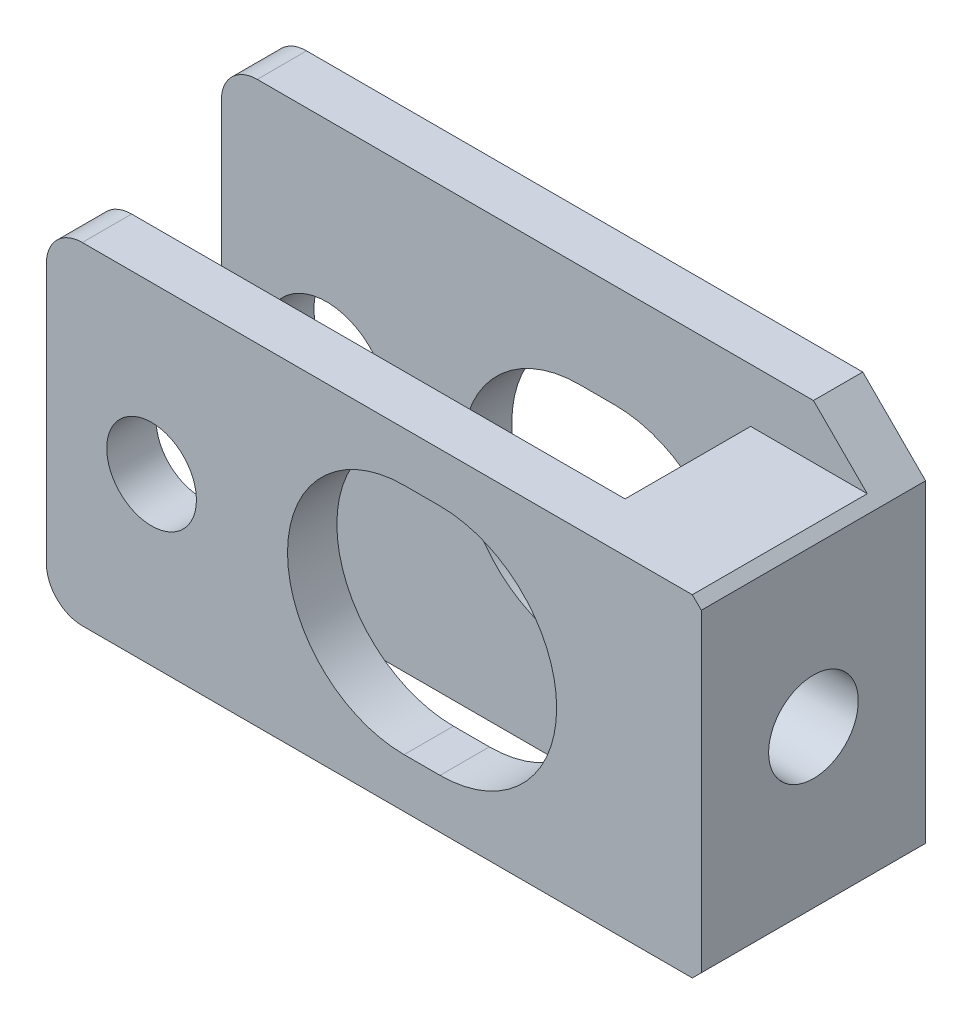
ISO-10303-21;
HEADER;
FILE_DESCRIPTION(('STEP AP214'),'2;1');
FILE_NAME('part.step','',(''),(''),'','','');
FILE_SCHEMA(('AUTOMOTIVE_DESIGN { 1 0 10303 214 1 1 1 1 }'));
ENDSEC;
DATA;
#1=APPLICATION_CONTEXT('core data for automotive mechanical design processes');
#2=APPLICATION_PROTOCOL_DEFINITION('international standard','automotive_design',2000,#1);
#3=PRODUCT_CONTEXT('',#1,'mechanical');
#4=PRODUCT('Part','Part','',(#3));
#5=PRODUCT_RELATED_PRODUCT_CATEGORY('part','',(#4));
#6=PRODUCT_DEFINITION_FORMATION('','',#4);
#7=PRODUCT_DEFINITION_CONTEXT('part definition',#1,'design');
#8=PRODUCT_DEFINITION('design','',#6,#7);
#9=PRODUCT_DEFINITION_SHAPE('','',#8);
#10=(LENGTH_UNIT() NAMED_UNIT(*) SI_UNIT(.MILLI.,.METRE.));
#11=(NAMED_UNIT(*) PLANE_ANGLE_UNIT() SI_UNIT($,.RADIAN.));
#12=(NAMED_UNIT(*) SI_UNIT($,.STERADIAN.) SOLID_ANGLE_UNIT());
#13=UNCERTAINTY_MEASURE_WITH_UNIT(LENGTH_MEASURE(1.E-05),#10,'distance_accuracy_value','');
#14=(GEOMETRIC_REPRESENTATION_CONTEXT(3) GLOBAL_UNCERTAINTY_ASSIGNED_CONTEXT((#13)) GLOBAL_UNIT_ASSIGNED_CONTEXT((#10,
#11,#12)) REPRESENTATION_CONTEXT('',''));
#15=CARTESIAN_POINT('',(0.,0.,0.));
#16=DIRECTION('',(0.,0.,1.));
#17=DIRECTION('',(1.,0.,0.));
#18=AXIS2_PLACEMENT_3D('',#15,#16,#17);
#19=CARTESIAN_POINT('',(234.055597075058,218.565954180002,12.5));
#20=DIRECTION('',(0.,1.,0.));
#21=DIRECTION('',(-1.,0.,0.));
#22=AXIS2_PLACEMENT_3D('',#19,#20,#21);
#23=PLANE('',#22);
#24=DIRECTION('',(1.,0.,0.));
#25=VECTOR('',#24,1.);
#26=CARTESIAN_POINT('',(234.055597075058,218.565954180002,12.5));
#27=LINE('',#26,#25);
#28=CARTESIAN_POINT('',(236.055597075058,218.565954180002,12.5));
#29=VERTEX_POINT('',#28);
#30=CARTESIAN_POINT('',(270.055597075058,218.565954180002,12.5));
#31=VERTEX_POINT('',#30);
#32=EDGE_CURVE('E369',#29,#31,#27,.T.);
#33=ORIENTED_EDGE('',*,*,#32,.F.);
#34=DIRECTION('',(0.,0.,-1.));
#35=VECTOR('',#34,1.);
#36=CARTESIAN_POINT('',(236.055597075058,218.565954180002,12.5));
#37=LINE('',#36,#35);
#38=CARTESIAN_POINT('',(236.055597075058,218.565954180002,9.75));
#39=VERTEX_POINT('',#38);
#40=EDGE_CURVE('E40',#29,#39,#37,.T.);
#41=ORIENTED_EDGE('',*,*,#40,.T.);
#42=DIRECTION('',(1.,0.,0.));
#43=VECTOR('',#42,1.);
#44=CARTESIAN_POINT('',(234.055597075058,218.565954180002,9.75));
#45=LINE('',#44,#43);
#46=CARTESIAN_POINT('',(263.555597075058,218.565954180002,9.75));
#47=VERTEX_POINT('',#46);
#48=EDGE_CURVE('E367',#39,#47,#45,.T.);
#49=ORIENTED_EDGE('',*,*,#48,.T.);
#50=DIRECTION('',(0.,0.,-1.));
#51=VECTOR('',#50,1.);
#52=CARTESIAN_POINT('',(263.555597075058,218.565954180002,2.75));
#53=LINE('',#52,#51);
#54=CARTESIAN_POINT('',(263.555597075058,218.565954180002,2.75));
#55=VERTEX_POINT('',#54);
#56=EDGE_CURVE('E379',#47,#55,#53,.T.);
#57=ORIENTED_EDGE('',*,*,#56,.T.);
#58=DIRECTION('',(-1.,0.,0.));
#59=VECTOR('',#58,1.);
#60=CARTESIAN_POINT('',(234.055597075058,218.565954180002,2.75));
#61=LINE('',#60,#59);
#62=CARTESIAN_POINT('',(270.055597075058,218.565954180002,2.75));
#63=VERTEX_POINT('',#62);
#64=EDGE_CURVE('E287',#63,#55,#61,.T.);
#65=ORIENTED_EDGE('',*,*,#64,.F.);
#66=DIRECTION('',(0.,0.,-1.));
#67=VECTOR('',#66,1.);
#68=CARTESIAN_POINT('',(270.055597075058,218.565954180002,2.75));
#69=LINE('',#68,#67);
#70=EDGE_CURVE('E311',#63,#31,#69,.F.);
#71=ORIENTED_EDGE('',*,*,#70,.T.);
#72=EDGE_LOOP('',(#33,#41,#49,#57,#65,#71));
#73=FACE_BOUND('',#72,.T.);
#74=ADVANCED_FACE('F32',(#73),#23,.F.);
#75=CARTESIAN_POINT('',(234.055597075058,237.065954180002,12.5));
#76=DIRECTION('',(0.,-1.,0.));
#77=DIRECTION('',(0.,0.,-1.));
#78=AXIS2_PLACEMENT_3D('',#75,#76,#77);
#79=PLANE('',#78);
#80=DIRECTION('',(1.,0.,0.));
#81=VECTOR('',#80,1.);
#82=CARTESIAN_POINT('',(234.055597075058,237.065954180002,9.75));
#83=LINE('',#82,#81);
#84=CARTESIAN_POINT('',(236.055597075058,237.065954180002,9.75));
#85=VERTEX_POINT('',#84);
#86=CARTESIAN_POINT('',(263.555597075058,237.065954180002,9.75));
#87=VERTEX_POINT('',#86);
#88=EDGE_CURVE('E385',#85,#87,#83,.T.);
#89=ORIENTED_EDGE('',*,*,#88,.F.);
#90=DIRECTION('',(0.,0.,-1.));
#91=VECTOR('',#90,1.);
#92=CARTESIAN_POINT('',(236.055597075058,237.065954180002,12.5));
#93=LINE('',#92,#91);
#94=CARTESIAN_POINT('',(236.055597075058,237.065954180002,12.5));
#95=VERTEX_POINT('',#94);
#96=EDGE_CURVE('E55',#85,#95,#93,.F.);
#97=ORIENTED_EDGE('',*,*,#96,.T.);
#98=DIRECTION('',(-1.,0.,0.));
#99=VECTOR('',#98,1.);
#100=CARTESIAN_POINT('',(234.055597075058,237.065954180002,12.5));
#101=LINE('',#100,#99);
#102=CARTESIAN_POINT('',(270.055597075058,237.065954180002,12.5));
#103=VERTEX_POINT('',#102);
#104=EDGE_CURVE('E462',#103,#95,#101,.T.);
#105=ORIENTED_EDGE('',*,*,#104,.F.);
#106=DIRECTION('',(0.,0.,-1.));
#107=VECTOR('',#106,1.);
#108=CARTESIAN_POINT('',(270.055597075058,237.065954180002,2.75));
#109=LINE('',#108,#107);
#110=CARTESIAN_POINT('',(270.055597075058,237.065954180002,2.75));
#111=VERTEX_POINT('',#110);
#112=EDGE_CURVE('E330',#103,#111,#109,.T.);
#113=ORIENTED_EDGE('',*,*,#112,.T.);
#114=DIRECTION('',(1.,0.,0.));
#115=VECTOR('',#114,1.);
#116=CARTESIAN_POINT('',(234.055597075058,237.065954180002,2.75));
#117=LINE('',#116,#115);
#118=CARTESIAN_POINT('',(263.555597075058,237.065954180002,2.75));
#119=VERTEX_POINT('',#118);
#120=EDGE_CURVE('E466',#119,#111,#117,.T.);
#121=ORIENTED_EDGE('',*,*,#120,.F.);
#122=DIRECTION('',(0.,0.,-1.));
#123=VECTOR('',#122,1.);
#124=CARTESIAN_POINT('',(263.555597075058,237.065954180002,2.75));
#125=LINE('',#124,#123);
#126=EDGE_CURVE('E380',#87,#119,#125,.T.);
#127=ORIENTED_EDGE('',*,*,#126,.F.);
#128=EDGE_LOOP('',(#89,#97,#105,#113,#121,#127));
#129=FACE_BOUND('',#128,.T.);
#130=ADVANCED_FACE('F546',(#129),#79,.F.);
#131=CARTESIAN_POINT('',(234.055597075058,237.065954180002,12.5));
#132=DIRECTION('',(1.,0.,0.));
#133=DIRECTION('',(0.,1.,0.));
#134=AXIS2_PLACEMENT_3D('',#131,#132,#133);
#135=PLANE('',#134);
#136=DIRECTION('',(0.,1.,0.));
#137=VECTOR('',#136,1.);
#138=CARTESIAN_POINT('',(234.055597075058,218.565954180002,2.75));
#139=LINE('',#138,#137);
#140=CARTESIAN_POINT('',(234.055597075058,217.565954180002,2.75));
#141=VERTEX_POINT('',#140);
#142=CARTESIAN_POINT('',(234.055597075058,238.065954180002,2.75));
#143=VERTEX_POINT('',#142);
#144=EDGE_CURVE('E393',#141,#143,#139,.T.);
#145=ORIENTED_EDGE('',*,*,#144,.T.);
#146=DIRECTION('',(0.,0.,1.));
#147=VECTOR('',#146,1.);
#148=CARTESIAN_POINT('',(234.055597075058,238.065954180002,0.));
#149=LINE('',#148,#147);
#150=CARTESIAN_POINT('',(234.055597075058,238.065954180002,0.));
#151=VERTEX_POINT('',#150);
#152=EDGE_CURVE('E344',#143,#151,#149,.F.);
#153=ORIENTED_EDGE('',*,*,#152,.T.);
#154=DIRECTION('',(0.,-1.,0.));
#155=VECTOR('',#154,1.);
#156=CARTESIAN_POINT('',(234.055597075058,237.065954180002,0.));
#157=LINE('',#156,#155);
#158=CARTESIAN_POINT('',(234.055597075058,217.565954180002,0.));
#159=VERTEX_POINT('',#158);
#160=EDGE_CURVE('E459',#151,#159,#157,.T.);
#161=ORIENTED_EDGE('',*,*,#160,.T.);
#162=DIRECTION('',(0.,0.,-1.));
#163=VECTOR('',#162,1.);
#164=CARTESIAN_POINT('',(234.055597075058,217.565954180002,12.5));
#165=LINE('',#164,#163);
#166=EDGE_CURVE('E342',#159,#141,#165,.F.);
#167=ORIENTED_EDGE('',*,*,#166,.T.);
#168=EDGE_LOOP('',(#145,#153,#161,#167));
#169=FACE_BOUND('',#168,.T.);
#170=ADVANCED_FACE('F526',(#169),#135,.F.);
#171=CARTESIAN_POINT('',(253.993323780456,227.815954180002,12.5));
#172=DIRECTION('',(0.,0.,-1.));
#173=DIRECTION('',(-1.,0.,0.));
#174=AXIS2_PLACEMENT_3D('',#171,#172,#173);
#175=CYLINDRICAL_SURFACE('',#174,6.50000000000001);
#176=CARTESIAN_POINT('',(253.993323780456,227.815954180002,2.75));
#177=DIRECTION('',(0.,0.,-1.));
#178=DIRECTION('',(-1.,0.,0.));
#179=AXIS2_PLACEMENT_3D('',#176,#177,#178);
#180=CIRCLE('',#179,6.50000000000001);
#181=CARTESIAN_POINT('',(253.993323780456,221.315954180002,2.75));
#182=VERTEX_POINT('',#181);
#183=CARTESIAN_POINT('',(253.993323780456,234.315954180002,2.75));
#184=VERTEX_POINT('',#183);
#185=EDGE_CURVE('E414',#182,#184,#180,.T.);
#186=ORIENTED_EDGE('',*,*,#185,.F.);
#187=DIRECTION('',(0.,0.,-1.));
#188=VECTOR('',#187,1.);
#189=CARTESIAN_POINT('',(253.993323780456,221.315954180002,12.5));
#190=LINE('',#189,#188);
#191=CARTESIAN_POINT('',(253.993323780456,221.315954180002,0.));
#192=VERTEX_POINT('',#191);
#193=EDGE_CURVE('E452',#182,#192,#190,.T.);
#194=ORIENTED_EDGE('',*,*,#193,.T.);
#195=CARTESIAN_POINT('',(253.993323780456,227.815954180002,0.));
#196=DIRECTION('',(0.,0.,1.));
#197=DIRECTION('',(1.,0.,0.));
#198=AXIS2_PLACEMENT_3D('',#195,#196,#197);
#199=CIRCLE('',#198,6.50000000000001);
#200=CARTESIAN_POINT('',(253.993323780456,234.315954180002,0.));
#201=VERTEX_POINT('',#200);
#202=EDGE_CURVE('E419',#201,#192,#199,.T.);
#203=ORIENTED_EDGE('',*,*,#202,.F.);
#204=DIRECTION('',(0.,0.,-1.));
#205=VECTOR('',#204,1.);
#206=CARTESIAN_POINT('',(253.993323780456,234.315954180002,12.5));
#207=LINE('',#206,#205);
#208=EDGE_CURVE('E430',#184,#201,#207,.T.);
#209=ORIENTED_EDGE('',*,*,#208,.F.);
#210=EDGE_LOOP('',(#186,#194,#203,#209));
#211=FACE_BOUND('',#210,.T.);
#212=ADVANCED_FACE('F613',(#211),#175,.F.);
#213=CARTESIAN_POINT('',(253.993323780456,221.315954180002,12.5));
#214=DIRECTION('',(0.,1.,0.));
#215=DIRECTION('',(0.,0.,1.));
#216=AXIS2_PLACEMENT_3D('',#213,#214,#215);
#217=PLANE('',#216);
#218=DIRECTION('',(-1.,0.,0.));
#219=VECTOR('',#218,1.);
#220=CARTESIAN_POINT('',(253.993323780456,221.315954180002,2.75));
#221=LINE('',#220,#219);
#222=CARTESIAN_POINT('',(255.993323780456,221.315954180002,2.75));
#223=VERTEX_POINT('',#222);
#224=EDGE_CURVE('E412',#223,#182,#221,.T.);
#225=ORIENTED_EDGE('',*,*,#224,.F.);
#226=DIRECTION('',(0.,0.,-1.));
#227=VECTOR('',#226,1.);
#228=CARTESIAN_POINT('',(255.993323780456,221.315954180002,12.5));
#229=LINE('',#228,#227);
#230=CARTESIAN_POINT('',(255.993323780456,221.315954180002,0.));
#231=VERTEX_POINT('',#230);
#232=EDGE_CURVE('E448',#223,#231,#229,.T.);
#233=ORIENTED_EDGE('',*,*,#232,.T.);
#234=DIRECTION('',(1.,0.,0.));
#235=VECTOR('',#234,1.);
#236=CARTESIAN_POINT('',(253.993323780456,221.315954180002,0.));
#237=LINE('',#236,#235);
#238=EDGE_CURVE('E433',#192,#231,#237,.T.);
#239=ORIENTED_EDGE('',*,*,#238,.F.);
#240=ORIENTED_EDGE('',*,*,#193,.F.);
#241=EDGE_LOOP('',(#225,#233,#239,#240));
#242=FACE_BOUND('',#241,.T.);
#243=ADVANCED_FACE('F608',(#242),#217,.T.);
#244=CARTESIAN_POINT('',(255.993323780456,227.815954180002,12.5));
#245=DIRECTION('',(0.,0.,-1.));
#246=DIRECTION('',(-1.,0.,0.));
#247=AXIS2_PLACEMENT_3D('',#244,#245,#246);
#248=CYLINDRICAL_SURFACE('',#247,6.50000000000001);
#249=CARTESIAN_POINT('',(255.993323780456,227.815954180002,2.75));
#250=DIRECTION('',(0.,0.,-1.));
#251=DIRECTION('',(-1.,0.,0.));
#252=AXIS2_PLACEMENT_3D('',#249,#250,#251);
#253=CIRCLE('',#252,6.50000000000001);
#254=CARTESIAN_POINT('',(255.993323780456,234.315954180002,2.75));
#255=VERTEX_POINT('',#254);
#256=EDGE_CURVE('E410',#255,#223,#253,.T.);
#257=ORIENTED_EDGE('',*,*,#256,.F.);
#258=DIRECTION('',(0.,0.,-1.));
#259=VECTOR('',#258,1.);
#260=CARTESIAN_POINT('',(255.993323780456,234.315954180002,12.5));
#261=LINE('',#260,#259);
#262=CARTESIAN_POINT('',(255.993323780456,234.315954180002,0.));
#263=VERTEX_POINT('',#262);
#264=EDGE_CURVE('E444',#255,#263,#261,.T.);
#265=ORIENTED_EDGE('',*,*,#264,.T.);
#266=CARTESIAN_POINT('',(255.993323780456,227.815954180002,0.));
#267=DIRECTION('',(0.,0.,1.));
#268=DIRECTION('',(1.,0.,0.));
#269=AXIS2_PLACEMENT_3D('',#266,#267,#268);
#270=CIRCLE('',#269,6.50000000000001);
#271=EDGE_CURVE('E436',#231,#263,#270,.T.);
#272=ORIENTED_EDGE('',*,*,#271,.F.);
#273=ORIENTED_EDGE('',*,*,#232,.F.);
#274=EDGE_LOOP('',(#257,#265,#272,#273));
#275=FACE_BOUND('',#274,.T.);
#276=ADVANCED_FACE('F603',(#275),#248,.F.);
#277=CARTESIAN_POINT('',(253.993323780456,234.315954180002,12.5));
#278=DIRECTION('',(0.,-1.,0.));
#279=DIRECTION('',(0.,0.,-1.));
#280=AXIS2_PLACEMENT_3D('',#277,#278,#279);
#281=PLANE('',#280);
#282=DIRECTION('',(1.,0.,0.));
#283=VECTOR('',#282,1.);
#284=CARTESIAN_POINT('',(253.993323780456,234.315954180002,2.75));
#285=LINE('',#284,#283);
#286=EDGE_CURVE('E408',#184,#255,#285,.T.);
#287=ORIENTED_EDGE('',*,*,#286,.F.);
#288=ORIENTED_EDGE('',*,*,#208,.T.);
#289=DIRECTION('',(-1.,0.,0.));
#290=VECTOR('',#289,1.);
#291=CARTESIAN_POINT('',(253.993323780456,234.315954180002,0.));
#292=LINE('',#291,#290);
#293=EDGE_CURVE('E423',#263,#201,#292,.T.);
#294=ORIENTED_EDGE('',*,*,#293,.F.);
#295=ORIENTED_EDGE('',*,*,#264,.F.);
#296=EDGE_LOOP('',(#287,#288,#294,#295));
#297=FACE_BOUND('',#296,.T.);
#298=ADVANCED_FACE('F593',(#297),#281,.T.);
#299=CARTESIAN_POINT('',(239.915979081558,227.815953297462,12.5));
#300=DIRECTION('',(0.,0.,-1.));
#301=DIRECTION('',(-1.,0.,0.));
#302=AXIS2_PLACEMENT_3D('',#299,#300,#301);
#303=CYLINDRICAL_SURFACE('',#302,3.45);
#304=CARTESIAN_POINT('',(239.915979081558,227.815953297462,2.75));
#305=DIRECTION('',(0.,0.,-1.));
#306=DIRECTION('',(-1.,0.,0.));
#307=AXIS2_PLACEMENT_3D('',#304,#305,#306);
#308=CIRCLE('',#307,3.45);
#309=CARTESIAN_POINT('',(236.465979081558,227.815953297462,2.75));
#310=VERTEX_POINT('',#309);
#311=EDGE_CURVE('E407',#310,#310,#308,.T.);
#312=ORIENTED_EDGE('',*,*,#311,.F.);
#313=EDGE_LOOP('',(#312));
#314=FACE_BOUND('',#313,.T.);
#315=CARTESIAN_POINT('',(239.915979081558,227.815953297462,0.));
#316=DIRECTION('',(0.,0.,1.));
#317=DIRECTION('',(1.,0.,0.));
#318=AXIS2_PLACEMENT_3D('',#315,#316,#317);
#319=CIRCLE('',#318,3.45);
#320=CARTESIAN_POINT('',(243.365979081558,227.815953297462,0.));
#321=VERTEX_POINT('',#320);
#322=EDGE_CURVE('E416',#321,#321,#319,.T.);
#323=ORIENTED_EDGE('',*,*,#322,.F.);
#324=EDGE_LOOP('',(#323));
#325=FACE_BOUND('',#324,.T.);
#326=ADVANCED_FACE('F589',(#314,#325),#303,.F.);
#327=CARTESIAN_POINT('',(270.555597075058,218.565954180002,12.5));
#328=DIRECTION('',(0.,0.,1.));
#329=DIRECTION('',(1.,0.,0.));
#330=AXIS2_PLACEMENT_3D('',#327,#328,#329);
#331=PLANE('',#330);
#332=DIRECTION('',(1.,0.,0.));
#333=VECTOR('',#332,1.);
#334=CARTESIAN_POINT('',(253.993323780456,221.315954180002,12.5));
#335=LINE('',#334,#333);
#336=CARTESIAN_POINT('',(253.993323780456,221.315954180002,12.5));
#337=VERTEX_POINT('',#336);
#338=CARTESIAN_POINT('',(255.993323780456,221.315954180002,12.5));
#339=VERTEX_POINT('',#338);
#340=EDGE_CURVE('E422',#337,#339,#335,.T.);
#341=ORIENTED_EDGE('',*,*,#340,.F.);
#342=CARTESIAN_POINT('',(253.993323780456,227.815954180002,12.5));
#343=DIRECTION('',(0.,0.,1.));
#344=DIRECTION('',(1.,0.,0.));
#345=AXIS2_PLACEMENT_3D('',#342,#343,#344);
#346=CIRCLE('',#345,6.50000000000001);
#347=CARTESIAN_POINT('',(253.993323780456,234.315954180002,12.5));
#348=VERTEX_POINT('',#347);
#349=EDGE_CURVE('E420',#348,#337,#346,.T.);
#350=ORIENTED_EDGE('',*,*,#349,.F.);
#351=DIRECTION('',(-1.,0.,0.));
#352=VECTOR('',#351,1.);
#353=CARTESIAN_POINT('',(253.993323780456,234.315954180002,12.5));
#354=LINE('',#353,#352);
#355=CARTESIAN_POINT('',(255.993323780456,234.315954180002,12.5));
#356=VERTEX_POINT('',#355);
#357=EDGE_CURVE('E428',#356,#348,#354,.T.);
#358=ORIENTED_EDGE('',*,*,#357,.F.);
#359=CARTESIAN_POINT('',(255.993323780456,227.815954180002,12.5));
#360=DIRECTION('',(0.,0.,1.));
#361=DIRECTION('',(1.,0.,0.));
#362=AXIS2_PLACEMENT_3D('',#359,#360,#361);
#363=CIRCLE('',#362,6.50000000000001);
#364=EDGE_CURVE('E425',#339,#356,#363,.T.);
#365=ORIENTED_EDGE('',*,*,#364,.F.);
#366=EDGE_LOOP('',(#341,#350,#358,#365));
#367=FACE_BOUND('',#366,.T.);
#368=ORIENTED_EDGE('',*,*,#104,.T.);
#369=CARTESIAN_POINT('',(236.055597075058,235.065954180002,12.5));
#370=DIRECTION('',(0.,0.,1.));
#371=DIRECTION('',(1.,0.,0.));
#372=AXIS2_PLACEMENT_3D('',#369,#370,#371);
#373=CIRCLE('',#372,2.);
#374=CARTESIAN_POINT('',(234.055597075058,235.065954180002,12.5));
#375=VERTEX_POINT('',#374);
#376=EDGE_CURVE('E361',#95,#375,#373,.T.);
#377=ORIENTED_EDGE('',*,*,#376,.T.);
#378=DIRECTION('',(0.,-1.,0.));
#379=VECTOR('',#378,1.);
#380=CARTESIAN_POINT('',(234.055597075058,237.065954180002,12.5));
#381=LINE('',#380,#379);
#382=CARTESIAN_POINT('',(234.055597075058,220.565954180002,12.5));
#383=VERTEX_POINT('',#382);
#384=EDGE_CURVE('E464',#375,#383,#381,.T.);
#385=ORIENTED_EDGE('',*,*,#384,.T.);
#386=CARTESIAN_POINT('',(236.055597075058,220.565954180002,12.5));
#387=DIRECTION('',(0.,0.,1.));
#388=DIRECTION('',(1.,0.,0.));
#389=AXIS2_PLACEMENT_3D('',#386,#387,#388);
#390=CIRCLE('',#389,2.);
#391=EDGE_CURVE('E47',#383,#29,#390,.T.);
#392=ORIENTED_EDGE('',*,*,#391,.T.);
#393=ORIENTED_EDGE('',*,*,#32,.T.);
#394=DIRECTION('',(-0.707106781186548,-0.707106781186548,0.));
#395=VECTOR('',#394,1.);
#396=CARTESIAN_POINT('',(270.305597075058,218.815954180002,12.5));
#397=LINE('',#396,#395);
#398=CARTESIAN_POINT('',(270.555597075058,219.065954180002,12.5));
#399=VERTEX_POINT('',#398);
#400=EDGE_CURVE('E314',#31,#399,#397,.F.);
#401=ORIENTED_EDGE('',*,*,#400,.T.);
#402=DIRECTION('',(0.,1.,0.));
#403=VECTOR('',#402,1.);
#404=CARTESIAN_POINT('',(270.555597075058,218.565954180002,12.5));
#405=LINE('',#404,#403);
#406=CARTESIAN_POINT('',(270.555597075058,236.565954180002,12.5));
#407=VERTEX_POINT('',#406);
#408=EDGE_CURVE('E458',#399,#407,#405,.T.);
#409=ORIENTED_EDGE('',*,*,#408,.T.);
#410=DIRECTION('',(-0.707106781186548,0.707106781186548,0.));
#411=VECTOR('',#410,1.);
#412=CARTESIAN_POINT('',(279.555597075058,227.565954180002,12.5));
#413=LINE('',#412,#411);
#414=EDGE_CURVE('E328',#407,#103,#413,.T.);
#415=ORIENTED_EDGE('',*,*,#414,.T.);
#416=EDGE_LOOP('',(#368,#377,#385,#392,#393,#401,#409,#415));
#417=FACE_BOUND('',#416,.T.);
#418=CARTESIAN_POINT('',(239.915979081558,227.815953297462,12.5));
#419=DIRECTION('',(0.,0.,1.));
#420=DIRECTION('',(1.,0.,0.));
#421=AXIS2_PLACEMENT_3D('',#418,#419,#420);
#422=CIRCLE('',#421,2.5);
#423=CARTESIAN_POINT('',(242.415979081558,227.815953297462,12.5));
#424=VERTEX_POINT('',#423);
#425=EDGE_CURVE('E389',#424,#424,#422,.T.);
#426=ORIENTED_EDGE('',*,*,#425,.F.);
#427=EDGE_LOOP('',(#426));
#428=FACE_BOUND('',#427,.T.);
#429=ADVANCED_FACE('F592',(#367,#417,#428),#331,.T.);
#430=CARTESIAN_POINT('',(270.555597075058,218.565954180002,0.));
#431=DIRECTION('',(0.,0.,1.));
#432=DIRECTION('',(1.,0.,0.));
#433=AXIS2_PLACEMENT_3D('',#430,#431,#432);
#434=PLANE('',#433);
#435=ORIENTED_EDGE('',*,*,#202,.T.);
#436=ORIENTED_EDGE('',*,*,#238,.T.);
#437=ORIENTED_EDGE('',*,*,#271,.T.);
#438=ORIENTED_EDGE('',*,*,#293,.T.);
#439=EDGE_LOOP('',(#435,#436,#437,#438));
#440=FACE_BOUND('',#439,.T.);
#441=ORIENTED_EDGE('',*,*,#160,.F.);
#442=CARTESIAN_POINT('',(236.055597075058,238.065954180002,0.));
#443=DIRECTION('',(0.,0.,1.));
#444=DIRECTION('',(1.,0.,0.));
#445=AXIS2_PLACEMENT_3D('',#442,#443,#444);
#446=CIRCLE('',#445,2.);
#447=CARTESIAN_POINT('',(236.055597075058,240.065954180002,0.));
#448=VERTEX_POINT('',#447);
#449=EDGE_CURVE('E348',#151,#448,#446,.F.);
#450=ORIENTED_EDGE('',*,*,#449,.T.);
#451=DIRECTION('',(-1.,0.,0.));
#452=VECTOR('',#451,1.);
#453=CARTESIAN_POINT('',(234.055597075058,240.065954180002,0.));
#454=LINE('',#453,#452);
#455=CARTESIAN_POINT('',(267.055597075058,240.065954180002,0.));
#456=VERTEX_POINT('',#455);
#457=EDGE_CURVE('E478',#456,#448,#454,.T.);
#458=ORIENTED_EDGE('',*,*,#457,.F.);
#459=DIRECTION('',(0.707106781186548,-0.707106781186548,0.));
#460=VECTOR('',#459,1.);
#461=CARTESIAN_POINT('',(267.055597075058,240.065954180002,0.));
#462=LINE('',#461,#460);
#463=CARTESIAN_POINT('',(270.555597075058,236.565954180002,0.));
#464=VERTEX_POINT('',#463);
#465=EDGE_CURVE('E324',#456,#464,#462,.T.);
#466=ORIENTED_EDGE('',*,*,#465,.T.);
#467=DIRECTION('',(0.,1.,0.));
#468=VECTOR('',#467,1.);
#469=CARTESIAN_POINT('',(270.555597075058,218.565954180002,0.));
#470=LINE('',#469,#468);
#471=CARTESIAN_POINT('',(270.555597075058,219.065954180002,0.));
#472=VERTEX_POINT('',#471);
#473=EDGE_CURVE('E456',#472,#464,#470,.T.);
#474=ORIENTED_EDGE('',*,*,#473,.F.);
#475=DIRECTION('',(0.707106781186548,0.707106781186548,0.));
#476=VECTOR('',#475,1.);
#477=CARTESIAN_POINT('',(267.055597075058,215.565954180002,0.));
#478=LINE('',#477,#476);
#479=CARTESIAN_POINT('',(267.055597075058,215.565954180002,0.));
#480=VERTEX_POINT('',#479);
#481=EDGE_CURVE('E318',#472,#480,#478,.F.);
#482=ORIENTED_EDGE('',*,*,#481,.T.);
#483=DIRECTION('',(1.,0.,0.));
#484=VECTOR('',#483,1.);
#485=CARTESIAN_POINT('',(270.555597075058,215.565954180002,0.));
#486=LINE('',#485,#484);
#487=CARTESIAN_POINT('',(236.055597075058,215.565954180002,0.));
#488=VERTEX_POINT('',#487);
#489=EDGE_CURVE('E295',#488,#480,#486,.T.);
#490=ORIENTED_EDGE('',*,*,#489,.F.);
#491=CARTESIAN_POINT('',(236.055597075058,217.565954180002,0.));
#492=DIRECTION('',(0.,0.,1.));
#493=DIRECTION('',(1.,0.,0.));
#494=AXIS2_PLACEMENT_3D('',#491,#492,#493);
#495=CIRCLE('',#494,2.);
#496=EDGE_CURVE('E346',#488,#159,#495,.F.);
#497=ORIENTED_EDGE('',*,*,#496,.T.);
#498=EDGE_LOOP('',(#441,#450,#458,#466,#474,#482,#490,#497));
#499=FACE_BOUND('',#498,.T.);
#500=ORIENTED_EDGE('',*,*,#322,.T.);
#501=EDGE_LOOP('',(#500));
#502=FACE_BOUND('',#501,.T.);
#503=ADVANCED_FACE('F503',(#440,#499,#502),#434,.F.);
#504=CARTESIAN_POINT('',(270.555597075058,218.565954180002,12.5));
#505=DIRECTION('',(-1.,0.,0.));
#506=DIRECTION('',(0.,0.,1.));
#507=AXIS2_PLACEMENT_3D('',#504,#505,#506);
#508=PLANE('',#507);
#509=CARTESIAN_POINT('',(270.555597075058,227.815954180002,6.24999999999997));
#510=DIRECTION('',(-1.,0.,0.));
#511=DIRECTION('',(0.,0.,1.));
#512=AXIS2_PLACEMENT_3D('',#509,#510,#511);
#513=CIRCLE('',#512,2.5);
#514=CARTESIAN_POINT('',(270.555597075058,227.815954180002,8.74999999999997));
#515=VERTEX_POINT('',#514);
#516=EDGE_CURVE('E275',#515,#515,#513,.T.);
#517=ORIENTED_EDGE('',*,*,#516,.T.);
#518=EDGE_LOOP('',(#517));
#519=FACE_BOUND('',#518,.T.);
#520=ORIENTED_EDGE('',*,*,#473,.T.);
#521=DIRECTION('',(0.,0.,1.));
#522=VECTOR('',#521,1.);
#523=CARTESIAN_POINT('',(270.555597075058,236.565954180002,2.75));
#524=LINE('',#523,#522);
#525=EDGE_CURVE('E326',#464,#407,#524,.T.);
#526=ORIENTED_EDGE('',*,*,#525,.T.);
#527=ORIENTED_EDGE('',*,*,#408,.F.);
#528=DIRECTION('',(0.,0.,-1.));
#529=VECTOR('',#528,1.);
#530=CARTESIAN_POINT('',(270.555597075058,219.065954180002,12.5));
#531=LINE('',#530,#529);
#532=EDGE_CURVE('E316',#399,#472,#531,.T.);
#533=ORIENTED_EDGE('',*,*,#532,.T.);
#534=EDGE_LOOP('',(#520,#526,#527,#533));
#535=FACE_BOUND('',#534,.T.);
#536=ADVANCED_FACE('F507',(#519,#535),#508,.F.);
#537=ORIENTED_EDGE('',*,*,#384,.F.);
#538=DIRECTION('',(0.,0.,-1.));
#539=VECTOR('',#538,1.);
#540=CARTESIAN_POINT('',(234.055597075058,235.065954180002,12.5));
#541=LINE('',#540,#539);
#542=CARTESIAN_POINT('',(234.055597075058,235.065954180002,9.75));
#543=VERTEX_POINT('',#542);
#544=EDGE_CURVE('E352',#375,#543,#541,.T.);
#545=ORIENTED_EDGE('',*,*,#544,.T.);
#546=DIRECTION('',(0.,1.,0.));
#547=VECTOR('',#546,1.);
#548=CARTESIAN_POINT('',(234.055597075058,218.565954180002,9.75));
#549=LINE('',#548,#547);
#550=CARTESIAN_POINT('',(234.055597075058,220.565954180002,9.75));
#551=VERTEX_POINT('',#550);
#552=EDGE_CURVE('E382',#551,#543,#549,.T.);
#553=ORIENTED_EDGE('',*,*,#552,.F.);
#554=DIRECTION('',(0.,0.,-1.));
#555=VECTOR('',#554,1.);
#556=CARTESIAN_POINT('',(234.055597075058,220.565954180002,12.5));
#557=LINE('',#556,#555);
#558=EDGE_CURVE('E350',#551,#383,#557,.F.);
#559=ORIENTED_EDGE('',*,*,#558,.T.);
#560=EDGE_LOOP('',(#537,#545,#553,#559));
#561=FACE_BOUND('',#560,.T.);
#562=ADVANCED_FACE('F611',(#561),#135,.F.);
#563=CARTESIAN_POINT('',(253.993323780456,227.815954180002,9.75));
#564=DIRECTION('',(0.,0.,1.));
#565=DIRECTION('',(1.,0.,0.));
#566=AXIS2_PLACEMENT_3D('',#563,#564,#565);
#567=CIRCLE('',#566,6.50000000000001);
#568=CARTESIAN_POINT('',(253.993323780456,234.315954180002,9.75));
#569=VERTEX_POINT('',#568);
#570=CARTESIAN_POINT('',(253.993323780456,221.315954180002,9.75));
#571=VERTEX_POINT('',#570);
#572=EDGE_CURVE('E405',#569,#571,#567,.T.);
#573=ORIENTED_EDGE('',*,*,#572,.F.);
#574=EDGE_CURVE('E441',#348,#569,#207,.T.);
#575=ORIENTED_EDGE('',*,*,#574,.F.);
#576=ORIENTED_EDGE('',*,*,#349,.T.);
#577=EDGE_CURVE('E453',#337,#571,#190,.T.);
#578=ORIENTED_EDGE('',*,*,#577,.T.);
#579=EDGE_LOOP('',(#573,#575,#576,#578));
#580=FACE_BOUND('',#579,.T.);
#581=ADVANCED_FACE('F606',(#580),#175,.F.);
#582=DIRECTION('',(1.,0.,0.));
#583=VECTOR('',#582,1.);
#584=CARTESIAN_POINT('',(253.993323780456,221.315954180002,9.75));
#585=LINE('',#584,#583);
#586=CARTESIAN_POINT('',(255.993323780456,221.315954180002,9.75));
#587=VERTEX_POINT('',#586);
#588=EDGE_CURVE('E403',#571,#587,#585,.T.);
#589=ORIENTED_EDGE('',*,*,#588,.F.);
#590=ORIENTED_EDGE('',*,*,#577,.F.);
#591=ORIENTED_EDGE('',*,*,#340,.T.);
#592=EDGE_CURVE('E449',#339,#587,#229,.T.);
#593=ORIENTED_EDGE('',*,*,#592,.T.);
#594=EDGE_LOOP('',(#589,#590,#591,#593));
#595=FACE_BOUND('',#594,.T.);
#596=ADVANCED_FACE('F601',(#595),#217,.T.);
#597=CARTESIAN_POINT('',(255.993323780456,227.815954180002,9.75));
#598=DIRECTION('',(0.,0.,1.));
#599=DIRECTION('',(1.,0.,0.));
#600=AXIS2_PLACEMENT_3D('',#597,#598,#599);
#601=CIRCLE('',#600,6.50000000000001);
#602=CARTESIAN_POINT('',(255.993323780456,234.315954180002,9.75));
#603=VERTEX_POINT('',#602);
#604=EDGE_CURVE('E401',#587,#603,#601,.T.);
#605=ORIENTED_EDGE('',*,*,#604,.F.);
#606=ORIENTED_EDGE('',*,*,#592,.F.);
#607=ORIENTED_EDGE('',*,*,#364,.T.);
#608=EDGE_CURVE('E445',#356,#603,#261,.T.);
#609=ORIENTED_EDGE('',*,*,#608,.T.);
#610=EDGE_LOOP('',(#605,#606,#607,#609));
#611=FACE_BOUND('',#610,.T.);
#612=ADVANCED_FACE('F597',(#611),#248,.F.);
#613=DIRECTION('',(-1.,0.,0.));
#614=VECTOR('',#613,1.);
#615=CARTESIAN_POINT('',(253.993323780456,234.315954180002,9.75));
#616=LINE('',#615,#614);
#617=EDGE_CURVE('E396',#603,#569,#616,.T.);
#618=ORIENTED_EDGE('',*,*,#617,.F.);
#619=ORIENTED_EDGE('',*,*,#608,.F.);
#620=ORIENTED_EDGE('',*,*,#357,.T.);
#621=ORIENTED_EDGE('',*,*,#574,.T.);
#622=EDGE_LOOP('',(#618,#619,#620,#621));
#623=FACE_BOUND('',#622,.T.);
#624=ADVANCED_FACE('F581',(#623),#281,.T.);
#625=CARTESIAN_POINT('',(234.055597075058,218.565954180002,2.75));
#626=DIRECTION('',(0.,0.,-1.));
#627=DIRECTION('',(-1.,0.,0.));
#628=AXIS2_PLACEMENT_3D('',#625,#626,#627);
#629=PLANE('',#628);
#630=ORIENTED_EDGE('',*,*,#185,.T.);
#631=ORIENTED_EDGE('',*,*,#286,.T.);
#632=ORIENTED_EDGE('',*,*,#256,.T.);
#633=ORIENTED_EDGE('',*,*,#224,.T.);
#634=EDGE_LOOP('',(#630,#631,#632,#633));
#635=FACE_BOUND('',#634,.T.);
#636=ORIENTED_EDGE('',*,*,#311,.T.);
#637=EDGE_LOOP('',(#636));
#638=FACE_BOUND('',#637,.T.);
#639=DIRECTION('',(1.,0.,0.));
#640=VECTOR('',#639,1.);
#641=CARTESIAN_POINT('',(234.055597075058,240.065954180002,2.75));
#642=LINE('',#641,#640);
#643=CARTESIAN_POINT('',(236.055597075058,240.065954180002,2.75));
#644=VERTEX_POINT('',#643);
#645=CARTESIAN_POINT('',(267.055597075058,240.065954180002,2.75));
#646=VERTEX_POINT('',#645);
#647=EDGE_CURVE('E300',#644,#646,#642,.T.);
#648=ORIENTED_EDGE('',*,*,#647,.F.);
#649=CARTESIAN_POINT('',(236.055597075058,238.065954180002,2.75));
#650=DIRECTION('',(0.,0.,-1.));
#651=DIRECTION('',(-1.,0.,0.));
#652=AXIS2_PLACEMENT_3D('',#649,#650,#651);
#653=CIRCLE('',#652,2.);
#654=EDGE_CURVE('E340',#644,#143,#653,.F.);
#655=ORIENTED_EDGE('',*,*,#654,.T.);
#656=ORIENTED_EDGE('',*,*,#144,.F.);
#657=CARTESIAN_POINT('',(236.055597075058,217.565954180002,2.75));
#658=DIRECTION('',(0.,0.,-1.));
#659=DIRECTION('',(-1.,0.,0.));
#660=AXIS2_PLACEMENT_3D('',#657,#658,#659);
#661=CIRCLE('',#660,2.);
#662=CARTESIAN_POINT('',(236.055597075058,215.565954180002,2.75));
#663=VERTEX_POINT('',#662);
#664=EDGE_CURVE('E338',#141,#663,#661,.F.);
#665=ORIENTED_EDGE('',*,*,#664,.T.);
#666=DIRECTION('',(-1.,0.,0.));
#667=VECTOR('',#666,1.);
#668=CARTESIAN_POINT('',(234.055597075058,215.565954180002,2.75));
#669=LINE('',#668,#667);
#670=CARTESIAN_POINT('',(267.055597075058,215.565954180002,2.75));
#671=VERTEX_POINT('',#670);
#672=EDGE_CURVE('E297',#671,#663,#669,.T.);
#673=ORIENTED_EDGE('',*,*,#672,.F.);
#674=DIRECTION('',(-0.707106781186548,-0.707106781186548,0.));
#675=VECTOR('',#674,1.);
#676=CARTESIAN_POINT('',(267.055597075058,215.565954180002,2.75));
#677=LINE('',#676,#675);
#678=EDGE_CURVE('E309',#671,#63,#677,.F.);
#679=ORIENTED_EDGE('',*,*,#678,.T.);
#680=ORIENTED_EDGE('',*,*,#64,.T.);
#681=DIRECTION('',(0.,1.,0.));
#682=VECTOR('',#681,1.);
#683=CARTESIAN_POINT('',(263.555597075058,218.565954180002,2.75));
#684=LINE('',#683,#682);
#685=EDGE_CURVE('E397',#55,#119,#684,.T.);
#686=ORIENTED_EDGE('',*,*,#685,.T.);
#687=ORIENTED_EDGE('',*,*,#120,.T.);
#688=DIRECTION('',(-0.707106781186548,0.707106781186548,0.));
#689=VECTOR('',#688,1.);
#690=CARTESIAN_POINT('',(267.055597075058,240.065954180002,2.75));
#691=LINE('',#690,#689);
#692=EDGE_CURVE('E332',#111,#646,#691,.T.);
#693=ORIENTED_EDGE('',*,*,#692,.T.);
#694=EDGE_LOOP('',(#648,#655,#656,#665,#673,#679,#680,#686,#687,#693));
#695=FACE_BOUND('',#694,.T.);
#696=ADVANCED_FACE('F493',(#635,#638,#695),#629,.F.);
#697=CARTESIAN_POINT('',(263.555597075058,218.565954180002,2.75));
#698=DIRECTION('',(1.,0.,0.));
#699=DIRECTION('',(0.,0.,-1.));
#700=AXIS2_PLACEMENT_3D('',#697,#698,#699);
#701=PLANE('',#700);
#702=DIRECTION('',(0.,0.500000000000006,0.866025403784436));
#703=VECTOR('',#702,1.);
#704=CARTESIAN_POINT('',(263.555597075058,224.00544240335,6.24999999999996));
#705=LINE('',#704,#703);
#706=CARTESIAN_POINT('',(263.555597075058,224.00544240335,6.24999999999996));
#707=VERTEX_POINT('',#706);
#708=CARTESIAN_POINT('',(263.555597075058,225.910698291676,9.54999999999997));
#709=VERTEX_POINT('',#708);
#710=EDGE_CURVE('E274',#707,#709,#705,.T.);
#711=ORIENTED_EDGE('',*,*,#710,.F.);
#712=DIRECTION('',(0.,-0.500000000000007,0.866025403784435));
#713=VECTOR('',#712,1.);
#714=CARTESIAN_POINT('',(263.555597075058,225.910698291676,2.94999999999997));
#715=LINE('',#714,#713);
#716=CARTESIAN_POINT('',(263.555597075058,225.910698291676,2.94999999999997));
#717=VERTEX_POINT('',#716);
#718=EDGE_CURVE('E239',#717,#707,#715,.T.);
#719=ORIENTED_EDGE('',*,*,#718,.F.);
#720=DIRECTION('',(0.,-1.,0.));
#721=VECTOR('',#720,1.);
#722=CARTESIAN_POINT('',(263.555597075058,229.721210068328,2.94999999999997));
#723=LINE('',#722,#721);
#724=CARTESIAN_POINT('',(263.555597075058,229.721210068328,2.94999999999997));
#725=VERTEX_POINT('',#724);
#726=EDGE_CURVE('E257',#725,#717,#723,.T.);
#727=ORIENTED_EDGE('',*,*,#726,.F.);
#728=DIRECTION('',(0.,-0.500000000000003,-0.866025403784437));
#729=VECTOR('',#728,1.);
#730=CARTESIAN_POINT('',(263.555597075058,231.626465956654,6.25));
#731=LINE('',#730,#729);
#732=CARTESIAN_POINT('',(263.555597075058,231.626465956654,6.25));
#733=VERTEX_POINT('',#732);
#734=EDGE_CURVE('E260',#733,#725,#731,.T.);
#735=ORIENTED_EDGE('',*,*,#734,.F.);
#736=DIRECTION('',(0.,0.499999999999999,-0.866025403784439));
#737=VECTOR('',#736,1.);
#738=CARTESIAN_POINT('',(263.555597075058,229.721210068328,9.54999999999997));
#739=LINE('',#738,#737);
#740=CARTESIAN_POINT('',(263.555597075058,229.721210068328,9.54999999999997));
#741=VERTEX_POINT('',#740);
#742=EDGE_CURVE('E280',#741,#733,#739,.T.);
#743=ORIENTED_EDGE('',*,*,#742,.F.);
#744=DIRECTION('',(0.,1.,0.));
#745=VECTOR('',#744,1.);
#746=CARTESIAN_POINT('',(263.555597075058,225.910698291676,9.54999999999997));
#747=LINE('',#746,#745);
#748=EDGE_CURVE('E277',#709,#741,#747,.T.);
#749=ORIENTED_EDGE('',*,*,#748,.F.);
#750=EDGE_LOOP('',(#711,#719,#727,#735,#743,#749));
#751=FACE_BOUND('',#750,.T.);
#752=ORIENTED_EDGE('',*,*,#126,.T.);
#753=ORIENTED_EDGE('',*,*,#685,.F.);
#754=ORIENTED_EDGE('',*,*,#56,.F.);
#755=DIRECTION('',(0.,1.,0.));
#756=VECTOR('',#755,1.);
#757=CARTESIAN_POINT('',(263.555597075058,218.565954180002,9.75));
#758=LINE('',#757,#756);
#759=EDGE_CURVE('E377',#47,#87,#758,.T.);
#760=ORIENTED_EDGE('',*,*,#759,.T.);
#761=EDGE_LOOP('',(#752,#753,#754,#760));
#762=FACE_BOUND('',#761,.T.);
#763=ADVANCED_FACE('F580',(#751,#762),#701,.F.);
#764=CARTESIAN_POINT('',(234.055597075058,218.565954180002,9.75));
#765=DIRECTION('',(0.,0.,1.));
#766=DIRECTION('',(1.,0.,0.));
#767=AXIS2_PLACEMENT_3D('',#764,#765,#766);
#768=PLANE('',#767);
#769=ORIENTED_EDGE('',*,*,#572,.T.);
#770=ORIENTED_EDGE('',*,*,#588,.T.);
#771=ORIENTED_EDGE('',*,*,#604,.T.);
#772=ORIENTED_EDGE('',*,*,#617,.T.);
#773=EDGE_LOOP('',(#769,#770,#771,#772));
#774=FACE_BOUND('',#773,.T.);
#775=ORIENTED_EDGE('',*,*,#552,.T.);
#776=CARTESIAN_POINT('',(236.055597075058,235.065954180002,9.75));
#777=DIRECTION('',(0.,0.,1.));
#778=DIRECTION('',(1.,0.,0.));
#779=AXIS2_PLACEMENT_3D('',#776,#777,#778);
#780=CIRCLE('',#779,2.);
#781=EDGE_CURVE('E357',#543,#85,#780,.F.);
#782=ORIENTED_EDGE('',*,*,#781,.T.);
#783=ORIENTED_EDGE('',*,*,#88,.T.);
#784=ORIENTED_EDGE('',*,*,#759,.F.);
#785=ORIENTED_EDGE('',*,*,#48,.F.);
#786=CARTESIAN_POINT('',(236.055597075058,220.565954180002,9.75));
#787=DIRECTION('',(0.,0.,1.));
#788=DIRECTION('',(1.,0.,0.));
#789=AXIS2_PLACEMENT_3D('',#786,#787,#788);
#790=CIRCLE('',#789,2.);
#791=EDGE_CURVE('E355',#39,#551,#790,.F.);
#792=ORIENTED_EDGE('',*,*,#791,.T.);
#793=EDGE_LOOP('',(#775,#782,#783,#784,#785,#792));
#794=FACE_BOUND('',#793,.T.);
#795=CARTESIAN_POINT('',(239.915979081558,227.815953297462,9.75));
#796=DIRECTION('',(0.,0.,1.));
#797=DIRECTION('',(1.,0.,0.));
#798=AXIS2_PLACEMENT_3D('',#795,#796,#797);
#799=CIRCLE('',#798,2.5);
#800=CARTESIAN_POINT('',(242.415979081558,227.815953297462,9.75));
#801=VERTEX_POINT('',#800);
#802=EDGE_CURVE('E392',#801,#801,#799,.T.);
#803=ORIENTED_EDGE('',*,*,#802,.T.);
#804=EDGE_LOOP('',(#803));
#805=FACE_BOUND('',#804,.T.);
#806=ADVANCED_FACE('F373',(#774,#794,#805),#768,.F.);
#807=CARTESIAN_POINT('',(239.915979081558,227.815953297462,9.75));
#808=DIRECTION('',(0.,0.,1.));
#809=DIRECTION('',(1.,0.,0.));
#810=AXIS2_PLACEMENT_3D('',#807,#808,#809);
#811=CYLINDRICAL_SURFACE('',#810,2.5);
#812=ORIENTED_EDGE('',*,*,#802,.F.);
#813=EDGE_LOOP('',(#812));
#814=FACE_BOUND('',#813,.T.);
#815=ORIENTED_EDGE('',*,*,#425,.T.);
#816=EDGE_LOOP('',(#815));
#817=FACE_BOUND('',#816,.T.);
#818=ADVANCED_FACE('F574',(#814,#817),#811,.F.);
#819=CARTESIAN_POINT('',(234.055597075058,240.065954180002,2.75));
#820=DIRECTION('',(0.,1.,0.));
#821=DIRECTION('',(0.,0.,1.));
#822=AXIS2_PLACEMENT_3D('',#819,#820,#821);
#823=PLANE('',#822);
#824=ORIENTED_EDGE('',*,*,#457,.T.);
#825=DIRECTION('',(0.,0.,1.));
#826=VECTOR('',#825,1.);
#827=CARTESIAN_POINT('',(236.055597075058,240.065954180002,2.75));
#828=LINE('',#827,#826);
#829=EDGE_CURVE('E335',#448,#644,#828,.T.);
#830=ORIENTED_EDGE('',*,*,#829,.T.);
#831=ORIENTED_EDGE('',*,*,#647,.T.);
#832=DIRECTION('',(0.,0.,-1.));
#833=VECTOR('',#832,1.);
#834=CARTESIAN_POINT('',(267.055597075058,240.065954180002,0.));
#835=LINE('',#834,#833);
#836=EDGE_CURVE('E321',#646,#456,#835,.T.);
#837=ORIENTED_EDGE('',*,*,#836,.T.);
#838=EDGE_LOOP('',(#824,#830,#831,#837));
#839=FACE_BOUND('',#838,.T.);
#840=ADVANCED_FACE('F489',(#839),#823,.T.);
#841=CARTESIAN_POINT('',(234.055597075058,215.565954180002,2.75));
#842=DIRECTION('',(0.,1.,0.));
#843=DIRECTION('',(-1.,0.,0.));
#844=AXIS2_PLACEMENT_3D('',#841,#842,#843);
#845=PLANE('',#844);
#846=ORIENTED_EDGE('',*,*,#672,.T.);
#847=DIRECTION('',(0.,0.,-1.));
#848=VECTOR('',#847,1.);
#849=CARTESIAN_POINT('',(236.055597075058,215.565954180002,2.75));
#850=LINE('',#849,#848);
#851=EDGE_CURVE('E11',#663,#488,#850,.T.);
#852=ORIENTED_EDGE('',*,*,#851,.T.);
#853=ORIENTED_EDGE('',*,*,#489,.T.);
#854=DIRECTION('',(0.,0.,1.));
#855=VECTOR('',#854,1.);
#856=CARTESIAN_POINT('',(267.055597075058,215.565954180002,2.75));
#857=LINE('',#856,#855);
#858=EDGE_CURVE('E307',#480,#671,#857,.T.);
#859=ORIENTED_EDGE('',*,*,#858,.T.);
#860=EDGE_LOOP('',(#846,#852,#853,#859));
#861=FACE_BOUND('',#860,.T.);
#862=ADVANCED_FACE('F518',(#861),#845,.F.);
#863=CARTESIAN_POINT('',(267.055597075058,215.565954180002,2.75));
#864=DIRECTION('',(-0.707106781186547,0.707106781186547,0.));
#865=DIRECTION('',(-0.707106781186548,-0.707106781186548,0.));
#866=AXIS2_PLACEMENT_3D('',#863,#864,#865);
#867=PLANE('',#866);
#868=ORIENTED_EDGE('',*,*,#481,.F.);
#869=ORIENTED_EDGE('',*,*,#532,.F.);
#870=ORIENTED_EDGE('',*,*,#400,.F.);
#871=ORIENTED_EDGE('',*,*,#70,.F.);
#872=ORIENTED_EDGE('',*,*,#678,.F.);
#873=ORIENTED_EDGE('',*,*,#858,.F.);
#874=EDGE_LOOP('',(#868,#869,#870,#871,#872,#873));
#875=FACE_BOUND('',#874,.T.);
#876=ADVANCED_FACE('F512',(#875),#867,.F.);
#877=CARTESIAN_POINT('',(267.055597075058,240.065954180002,2.75));
#878=DIRECTION('',(0.707106781186547,0.707106781186547,0.));
#879=DIRECTION('',(-0.707106781186548,0.707106781186548,0.));
#880=AXIS2_PLACEMENT_3D('',#877,#878,#879);
#881=PLANE('',#880);
#882=ORIENTED_EDGE('',*,*,#414,.F.);
#883=ORIENTED_EDGE('',*,*,#525,.F.);
#884=ORIENTED_EDGE('',*,*,#465,.F.);
#885=ORIENTED_EDGE('',*,*,#836,.F.);
#886=ORIENTED_EDGE('',*,*,#692,.F.);
#887=ORIENTED_EDGE('',*,*,#112,.F.);
#888=EDGE_LOOP('',(#882,#883,#884,#885,#886,#887));
#889=FACE_BOUND('',#888,.T.);
#890=ADVANCED_FACE('F498',(#889),#881,.T.);
#891=CARTESIAN_POINT('',(266.555597075058,225.910698291676,2.94999999999997));
#892=DIRECTION('',(0.,-0.866025403784434,-0.500000000000007));
#893=DIRECTION('',(0.,0.500000000000007,-0.866025403784435));
#894=AXIS2_PLACEMENT_3D('',#891,#892,#893);
#895=PLANE('',#894);
#896=ORIENTED_EDGE('',*,*,#718,.T.);
#897=DIRECTION('',(-1.,0.,0.));
#898=VECTOR('',#897,1.);
#899=CARTESIAN_POINT('',(266.555597075058,224.00544240335,6.24999999999996));
#900=LINE('',#899,#898);
#901=CARTESIAN_POINT('',(266.555597075058,224.00544240335,6.24999999999996));
#902=VERTEX_POINT('',#901);
#903=EDGE_CURVE('E232',#902,#707,#900,.T.);
#904=ORIENTED_EDGE('',*,*,#903,.F.);
#905=DIRECTION('',(0.,-0.500000000000007,0.866025403784435));
#906=VECTOR('',#905,1.);
#907=CARTESIAN_POINT('',(266.555597075058,225.910698291676,2.94999999999997));
#908=LINE('',#907,#906);
#909=CARTESIAN_POINT('',(266.555597075058,225.910698291676,2.94999999999997));
#910=VERTEX_POINT('',#909);
#911=EDGE_CURVE('E236',#910,#902,#908,.T.);
#912=ORIENTED_EDGE('',*,*,#911,.F.);
#913=DIRECTION('',(-1.,0.,0.));
#914=VECTOR('',#913,1.);
#915=CARTESIAN_POINT('',(266.555597075058,225.910698291676,2.94999999999997));
#916=LINE('',#915,#914);
#917=EDGE_CURVE('E285',#910,#717,#916,.T.);
#918=ORIENTED_EDGE('',*,*,#917,.T.);
#919=EDGE_LOOP('',(#896,#904,#912,#918));
#920=FACE_BOUND('',#919,.T.);
#921=ADVANCED_FACE('F234',(#920),#895,.F.);
#922=CARTESIAN_POINT('',(266.555597075058,229.721210068328,2.94999999999997));
#923=DIRECTION('',(0.,0.,-1.));
#924=DIRECTION('',(-1.,0.,0.));
#925=AXIS2_PLACEMENT_3D('',#922,#923,#924);
#926=PLANE('',#925);
#927=ORIENTED_EDGE('',*,*,#726,.T.);
#928=ORIENTED_EDGE('',*,*,#917,.F.);
#929=DIRECTION('',(0.,-1.,0.));
#930=VECTOR('',#929,1.);
#931=CARTESIAN_POINT('',(266.555597075058,229.721210068328,2.94999999999997));
#932=LINE('',#931,#930);
#933=CARTESIAN_POINT('',(266.555597075058,229.721210068328,2.94999999999997));
#934=VERTEX_POINT('',#933);
#935=EDGE_CURVE('E244',#934,#910,#932,.T.);
#936=ORIENTED_EDGE('',*,*,#935,.F.);
#937=DIRECTION('',(-1.,0.,0.));
#938=VECTOR('',#937,1.);
#939=CARTESIAN_POINT('',(266.555597075058,229.721210068328,2.94999999999997));
#940=LINE('',#939,#938);
#941=EDGE_CURVE('E288',#934,#725,#940,.T.);
#942=ORIENTED_EDGE('',*,*,#941,.T.);
#943=EDGE_LOOP('',(#927,#928,#936,#942));
#944=FACE_BOUND('',#943,.T.);
#945=ADVANCED_FACE('F559',(#944),#926,.F.);
#946=CARTESIAN_POINT('',(266.555597075058,231.626465956654,6.25));
#947=DIRECTION('',(0.,0.866025403784437,-0.500000000000003));
#948=DIRECTION('',(0.,0.500000000000003,0.866025403784437));
#949=AXIS2_PLACEMENT_3D('',#946,#947,#948);
#950=PLANE('',#949);
#951=ORIENTED_EDGE('',*,*,#734,.T.);
#952=ORIENTED_EDGE('',*,*,#941,.F.);
#953=DIRECTION('',(0.,-0.500000000000003,-0.866025403784437));
#954=VECTOR('',#953,1.);
#955=CARTESIAN_POINT('',(266.555597075058,231.626465956654,6.25));
#956=LINE('',#955,#954);
#957=CARTESIAN_POINT('',(266.555597075058,231.626465956654,6.25));
#958=VERTEX_POINT('',#957);
#959=EDGE_CURVE('E270',#958,#934,#956,.T.);
#960=ORIENTED_EDGE('',*,*,#959,.F.);
#961=DIRECTION('',(-1.,0.,0.));
#962=VECTOR('',#961,1.);
#963=CARTESIAN_POINT('',(266.555597075058,231.626465956654,6.25));
#964=LINE('',#963,#962);
#965=EDGE_CURVE('E290',#958,#733,#964,.T.);
#966=ORIENTED_EDGE('',*,*,#965,.T.);
#967=EDGE_LOOP('',(#951,#952,#960,#966));
#968=FACE_BOUND('',#967,.T.);
#969=ADVANCED_FACE('F564',(#968),#950,.F.);
#970=CARTESIAN_POINT('',(266.555597075058,229.721210068328,9.54999999999997));
#971=DIRECTION('',(0.,0.866025403784439,0.499999999999999));
#972=DIRECTION('',(0.,-0.499999999999999,0.866025403784439));
#973=AXIS2_PLACEMENT_3D('',#970,#971,#972);
#974=PLANE('',#973);
#975=ORIENTED_EDGE('',*,*,#742,.T.);
#976=ORIENTED_EDGE('',*,*,#965,.F.);
#977=DIRECTION('',(0.,0.499999999999999,-0.866025403784439));
#978=VECTOR('',#977,1.);
#979=CARTESIAN_POINT('',(266.555597075058,229.721210068328,9.54999999999997));
#980=LINE('',#979,#978);
#981=CARTESIAN_POINT('',(266.555597075058,229.721210068328,9.54999999999997));
#982=VERTEX_POINT('',#981);
#983=EDGE_CURVE('E267',#982,#958,#980,.T.);
#984=ORIENTED_EDGE('',*,*,#983,.F.);
#985=DIRECTION('',(-1.,0.,0.));
#986=VECTOR('',#985,1.);
#987=CARTESIAN_POINT('',(266.555597075058,229.721210068328,9.54999999999997));
#988=LINE('',#987,#986);
#989=EDGE_CURVE('E292',#982,#741,#988,.T.);
#990=ORIENTED_EDGE('',*,*,#989,.T.);
#991=EDGE_LOOP('',(#975,#976,#984,#990));
#992=FACE_BOUND('',#991,.T.);
#993=ADVANCED_FACE('F825',(#992),#974,.F.);
#994=CARTESIAN_POINT('',(266.555597075058,225.910698291676,9.54999999999997));
#995=DIRECTION('',(0.,0.,1.));
#996=DIRECTION('',(1.,0.,0.));
#997=AXIS2_PLACEMENT_3D('',#994,#995,#996);
#998=PLANE('',#997);
#999=ORIENTED_EDGE('',*,*,#748,.T.);
#1000=ORIENTED_EDGE('',*,*,#989,.F.);
#1001=DIRECTION('',(0.,1.,0.));
#1002=VECTOR('',#1001,1.);
#1003=CARTESIAN_POINT('',(266.555597075058,225.910698291676,9.54999999999997));
#1004=LINE('',#1003,#1002);
#1005=CARTESIAN_POINT('',(266.555597075058,225.910698291676,9.54999999999997));
#1006=VERTEX_POINT('',#1005);
#1007=EDGE_CURVE('E252',#1006,#982,#1004,.T.);
#1008=ORIENTED_EDGE('',*,*,#1007,.F.);
#1009=DIRECTION('',(-1.,0.,0.));
#1010=VECTOR('',#1009,1.);
#1011=CARTESIAN_POINT('',(266.555597075058,225.910698291676,9.54999999999997));
#1012=LINE('',#1011,#1010);
#1013=EDGE_CURVE('E243',#1006,#709,#1012,.T.);
#1014=ORIENTED_EDGE('',*,*,#1013,.T.);
#1015=EDGE_LOOP('',(#999,#1000,#1008,#1014));
#1016=FACE_BOUND('',#1015,.T.);
#1017=ADVANCED_FACE('F834',(#1016),#998,.F.);
#1018=CARTESIAN_POINT('',(266.555597075058,224.00544240335,6.24999999999996));
#1019=DIRECTION('',(0.,-0.866025403784435,0.500000000000005));
#1020=DIRECTION('',(0.,-0.500000000000006,-0.866025403784436));
#1021=AXIS2_PLACEMENT_3D('',#1018,#1019,#1020);
#1022=PLANE('',#1021);
#1023=ORIENTED_EDGE('',*,*,#710,.T.);
#1024=ORIENTED_EDGE('',*,*,#1013,.F.);
#1025=DIRECTION('',(0.,0.500000000000006,0.866025403784436));
#1026=VECTOR('',#1025,1.);
#1027=CARTESIAN_POINT('',(266.555597075058,224.00544240335,6.24999999999996));
#1028=LINE('',#1027,#1026);
#1029=EDGE_CURVE('E247',#902,#1006,#1028,.T.);
#1030=ORIENTED_EDGE('',*,*,#1029,.F.);
#1031=ORIENTED_EDGE('',*,*,#903,.T.);
#1032=EDGE_LOOP('',(#1023,#1024,#1030,#1031));
#1033=FACE_BOUND('',#1032,.T.);
#1034=ADVANCED_FACE('F248',(#1033),#1022,.F.);
#1035=CARTESIAN_POINT('',(266.555597075058,224.00544240335,6.24999999999996));
#1036=DIRECTION('',(-1.,0.,0.));
#1037=DIRECTION('',(0.,0.,1.));
#1038=AXIS2_PLACEMENT_3D('',#1035,#1036,#1037);
#1039=PLANE('',#1038);
#1040=CARTESIAN_POINT('',(266.555597075058,227.815954180002,6.24999999999997));
#1041=DIRECTION('',(-1.,0.,0.));
#1042=DIRECTION('',(0.,0.,1.));
#1043=AXIS2_PLACEMENT_3D('',#1040,#1041,#1042);
#1044=CIRCLE('',#1043,2.5);
#1045=CARTESIAN_POINT('',(266.555597075058,227.815954180002,8.74999999999997));
#1046=VERTEX_POINT('',#1045);
#1047=EDGE_CURVE('E263',#1046,#1046,#1044,.T.);
#1048=ORIENTED_EDGE('',*,*,#1047,.F.);
#1049=EDGE_LOOP('',(#1048));
#1050=FACE_BOUND('',#1049,.T.);
#1051=ORIENTED_EDGE('',*,*,#911,.T.);
#1052=ORIENTED_EDGE('',*,*,#1029,.T.);
#1053=ORIENTED_EDGE('',*,*,#1007,.T.);
#1054=ORIENTED_EDGE('',*,*,#983,.T.);
#1055=ORIENTED_EDGE('',*,*,#959,.T.);
#1056=ORIENTED_EDGE('',*,*,#935,.T.);
#1057=EDGE_LOOP('',(#1051,#1052,#1053,#1054,#1055,#1056));
#1058=FACE_BOUND('',#1057,.T.);
#1059=ADVANCED_FACE('F254',(#1050,#1058),#1039,.T.);
#1060=CARTESIAN_POINT('',(270.555597075058,227.815954180002,6.24999999999997));
#1061=DIRECTION('',(-1.,0.,0.));
#1062=DIRECTION('',(0.,0.,1.));
#1063=AXIS2_PLACEMENT_3D('',#1060,#1061,#1062);
#1064=CYLINDRICAL_SURFACE('',#1063,2.5);
#1065=ORIENTED_EDGE('',*,*,#516,.F.);
#1066=EDGE_LOOP('',(#1065));
#1067=FACE_BOUND('',#1066,.T.);
#1068=ORIENTED_EDGE('',*,*,#1047,.T.);
#1069=EDGE_LOOP('',(#1068));
#1070=FACE_BOUND('',#1069,.T.);
#1071=ADVANCED_FACE('F533',(#1067,#1070),#1064,.F.);
#1072=CARTESIAN_POINT('',(236.055597075058,238.065954180002,2.75));
#1073=DIRECTION('',(0.,0.,-1.));
#1074=DIRECTION('',(-1.,0.,0.));
#1075=AXIS2_PLACEMENT_3D('',#1072,#1073,#1074);
#1076=CYLINDRICAL_SURFACE('',#1075,2.);
#1077=ORIENTED_EDGE('',*,*,#449,.F.);
#1078=ORIENTED_EDGE('',*,*,#152,.F.);
#1079=ORIENTED_EDGE('',*,*,#654,.F.);
#1080=ORIENTED_EDGE('',*,*,#829,.F.);
#1081=EDGE_LOOP('',(#1077,#1078,#1079,#1080));
#1082=FACE_BOUND('',#1081,.T.);
#1083=ADVANCED_FACE('F530',(#1082),#1076,.T.);
#1084=CARTESIAN_POINT('',(236.055597075058,235.065954180002,12.5));
#1085=DIRECTION('',(0.,0.,-1.));
#1086=DIRECTION('',(-1.,0.,0.));
#1087=AXIS2_PLACEMENT_3D('',#1084,#1085,#1086);
#1088=CYLINDRICAL_SURFACE('',#1087,2.);
#1089=ORIENTED_EDGE('',*,*,#376,.F.);
#1090=ORIENTED_EDGE('',*,*,#96,.F.);
#1091=ORIENTED_EDGE('',*,*,#781,.F.);
#1092=ORIENTED_EDGE('',*,*,#544,.F.);
#1093=EDGE_LOOP('',(#1089,#1090,#1091,#1092));
#1094=FACE_BOUND('',#1093,.T.);
#1095=ADVANCED_FACE('F532',(#1094),#1088,.T.);
#1096=CARTESIAN_POINT('',(236.055597075058,220.565954180002,12.5));
#1097=DIRECTION('',(0.,0.,-1.));
#1098=DIRECTION('',(-1.,0.,0.));
#1099=AXIS2_PLACEMENT_3D('',#1096,#1097,#1098);
#1100=CYLINDRICAL_SURFACE('',#1099,2.);
#1101=ORIENTED_EDGE('',*,*,#391,.F.);
#1102=ORIENTED_EDGE('',*,*,#558,.F.);
#1103=ORIENTED_EDGE('',*,*,#791,.F.);
#1104=ORIENTED_EDGE('',*,*,#40,.F.);
#1105=EDGE_LOOP('',(#1101,#1102,#1103,#1104));
#1106=FACE_BOUND('',#1105,.T.);
#1107=ADVANCED_FACE('F539',(#1106),#1100,.T.);
#1108=CARTESIAN_POINT('',(236.055597075058,217.565954180002,2.75));
#1109=DIRECTION('',(0.,0.,-1.));
#1110=DIRECTION('',(0.,1.,0.));
#1111=AXIS2_PLACEMENT_3D('',#1108,#1109,#1110);
#1112=CYLINDRICAL_SURFACE('',#1111,2.);
#1113=ORIENTED_EDGE('',*,*,#664,.F.);
#1114=ORIENTED_EDGE('',*,*,#166,.F.);
#1115=ORIENTED_EDGE('',*,*,#496,.F.);
#1116=ORIENTED_EDGE('',*,*,#851,.F.);
#1117=EDGE_LOOP('',(#1113,#1114,#1115,#1116));
#1118=FACE_BOUND('',#1117,.T.);
#1119=ADVANCED_FACE('F34',(#1118),#1112,.T.);
#1120=CLOSED_SHELL('',(#74,#130,#170,#212,#243,#276,#298,#326,#429,#503,#536,#562,#581,#596,
#612,#624,#696,#763,#806,#818,#840,#862,#876,#890,#921,#945,#969,#993,#1017,#1034,#1059,#1071,
#1083,#1095,#1107,#1119));
#1121=MANIFOLD_SOLID_BREP('B2',#1120);
#1122=ADVANCED_BREP_SHAPE_REPRESENTATION('',(#18,#1121),#14);
#1123=SHAPE_DEFINITION_REPRESENTATION(#9,#1122);
ENDSEC;
END-ISO-10303-21;
